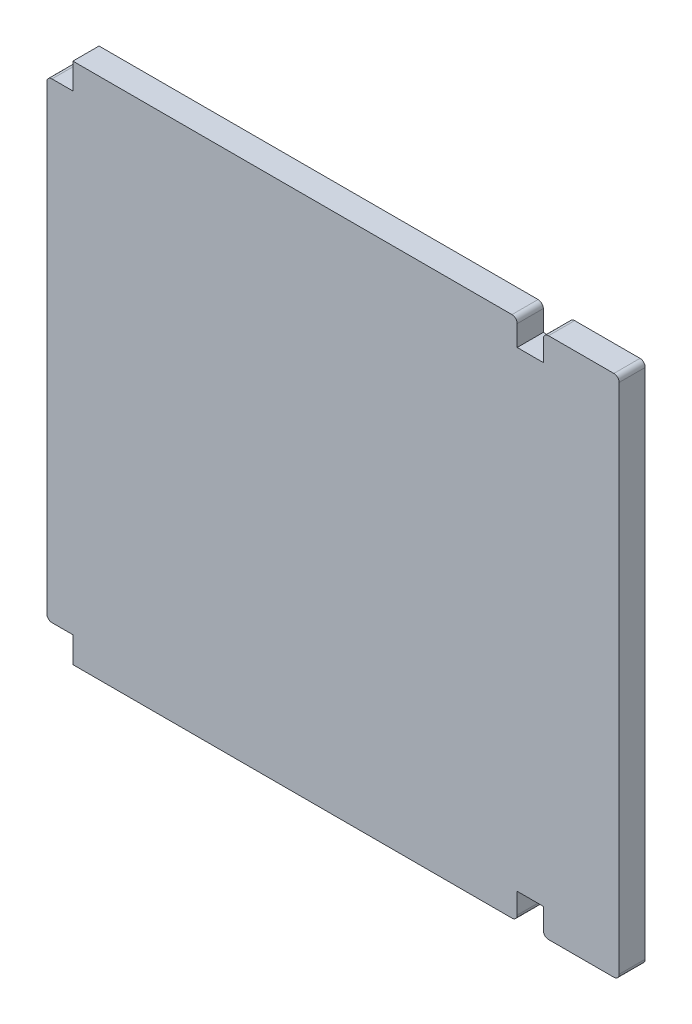
ISO-10303-21;
HEADER;
FILE_DESCRIPTION(('STEP AP214'),'2;1');
FILE_NAME('part.step','',(''),(''),'','','');
FILE_SCHEMA(('AUTOMOTIVE_DESIGN { 1 0 10303 214 1 1 1 1 }'));
ENDSEC;
DATA;
#1=APPLICATION_CONTEXT('core data for automotive mechanical design processes');
#2=APPLICATION_PROTOCOL_DEFINITION('international standard','automotive_design',2000,#1);
#3=PRODUCT_CONTEXT('',#1,'mechanical');
#4=PRODUCT('Part','Part','',(#3));
#5=PRODUCT_RELATED_PRODUCT_CATEGORY('part','',(#4));
#6=PRODUCT_DEFINITION_FORMATION('','',#4);
#7=PRODUCT_DEFINITION_CONTEXT('part definition',#1,'design');
#8=PRODUCT_DEFINITION('design','',#6,#7);
#9=PRODUCT_DEFINITION_SHAPE('','',#8);
#10=(LENGTH_UNIT() NAMED_UNIT(*) SI_UNIT(.MILLI.,.METRE.));
#11=(NAMED_UNIT(*) PLANE_ANGLE_UNIT() SI_UNIT($,.RADIAN.));
#12=(NAMED_UNIT(*) SI_UNIT($,.STERADIAN.) SOLID_ANGLE_UNIT());
#13=UNCERTAINTY_MEASURE_WITH_UNIT(LENGTH_MEASURE(1.E-05),#10,'distance_accuracy_value','');
#14=(GEOMETRIC_REPRESENTATION_CONTEXT(3) GLOBAL_UNCERTAINTY_ASSIGNED_CONTEXT((#13)) GLOBAL_UNIT_ASSIGNED_CONTEXT((#10,
#11,#12)) REPRESENTATION_CONTEXT('',''));
#15=CARTESIAN_POINT('',(0.,0.,0.));
#16=DIRECTION('',(0.,0.,1.));
#17=DIRECTION('',(1.,0.,0.));
#18=AXIS2_PLACEMENT_3D('',#15,#16,#17);
#19=CARTESIAN_POINT('',(0.,0.,5.));
#20=DIRECTION('',(1.,0.,0.));
#21=DIRECTION('',(0.,1.,0.));
#22=AXIS2_PLACEMENT_3D('',#19,#20,#21);
#23=PLANE('',#22);
#24=DIRECTION('',(0.,-1.,0.));
#25=VECTOR('',#24,1.);
#26=CARTESIAN_POINT('',(0.,0.,0.));
#27=LINE('',#26,#25);
#28=CARTESIAN_POINT('',(0.,4.95,0.));
#29=VERTEX_POINT('',#28);
#30=CARTESIAN_POINT('',(0.,0.,0.));
#31=VERTEX_POINT('',#30);
#32=EDGE_CURVE('E225',#29,#31,#27,.T.);
#33=ORIENTED_EDGE('',*,*,#32,.T.);
#34=DIRECTION('',(0.,0.,-1.));
#35=VECTOR('',#34,1.);
#36=CARTESIAN_POINT('',(0.,0.,5.));
#37=LINE('',#36,#35);
#38=CARTESIAN_POINT('',(0.,0.,5.));
#39=VERTEX_POINT('',#38);
#40=EDGE_CURVE('E207',#39,#31,#37,.T.);
#41=ORIENTED_EDGE('',*,*,#40,.F.);
#42=DIRECTION('',(0.,-1.,0.));
#43=VECTOR('',#42,1.);
#44=CARTESIAN_POINT('',(0.,0.,5.));
#45=LINE('',#44,#43);
#46=CARTESIAN_POINT('',(0.,4.95,5.));
#47=VERTEX_POINT('',#46);
#48=EDGE_CURVE('E213',#47,#39,#45,.T.);
#49=ORIENTED_EDGE('',*,*,#48,.F.);
#50=DIRECTION('',(0.,0.,-1.));
#51=VECTOR('',#50,1.);
#52=CARTESIAN_POINT('',(0.,4.95,5.));
#53=LINE('',#52,#51);
#54=EDGE_CURVE('E344',#47,#29,#53,.T.);
#55=ORIENTED_EDGE('',*,*,#54,.T.);
#56=EDGE_LOOP('',(#33,#41,#49,#55));
#57=FACE_BOUND('',#56,.T.);
#58=ADVANCED_FACE('F40',(#57),#23,.F.);
#59=CARTESIAN_POINT('',(0.,0.,5.));
#60=DIRECTION('',(0.,1.,0.));
#61=DIRECTION('',(0.,0.,1.));
#62=AXIS2_PLACEMENT_3D('',#59,#60,#61);
#63=PLANE('',#62);
#64=DIRECTION('',(1.,0.,0.));
#65=VECTOR('',#64,1.);
#66=CARTESIAN_POINT('',(0.,0.,0.));
#67=LINE('',#66,#65);
#68=CARTESIAN_POINT('',(84.,0.,0.));
#69=VERTEX_POINT('',#68);
#70=EDGE_CURVE('E370',#31,#69,#67,.T.);
#71=ORIENTED_EDGE('',*,*,#70,.T.);
#72=DIRECTION('',(0.,0.,-1.));
#73=VECTOR('',#72,1.);
#74=CARTESIAN_POINT('',(84.,0.,5.));
#75=LINE('',#74,#73);
#76=CARTESIAN_POINT('',(84.,0.,5.));
#77=VERTEX_POINT('',#76);
#78=EDGE_CURVE('E210',#69,#77,#75,.F.);
#79=ORIENTED_EDGE('',*,*,#78,.T.);
#80=DIRECTION('',(1.,0.,0.));
#81=VECTOR('',#80,1.);
#82=CARTESIAN_POINT('',(0.,0.,5.));
#83=LINE('',#82,#81);
#84=EDGE_CURVE('E202',#39,#77,#83,.T.);
#85=ORIENTED_EDGE('',*,*,#84,.F.);
#86=ORIENTED_EDGE('',*,*,#40,.T.);
#87=EDGE_LOOP('',(#71,#79,#85,#86));
#88=FACE_BOUND('',#87,.T.);
#89=ADVANCED_FACE('F205',(#88),#63,.F.);
#90=CARTESIAN_POINT('',(85.,0.,5.));
#91=DIRECTION('',(-1.,0.,0.));
#92=DIRECTION('',(0.,0.,1.));
#93=AXIS2_PLACEMENT_3D('',#90,#91,#92);
#94=PLANE('',#93);
#95=DIRECTION('',(0.,1.,0.));
#96=VECTOR('',#95,1.);
#97=CARTESIAN_POINT('',(85.,0.,5.));
#98=LINE('',#97,#96);
#99=CARTESIAN_POINT('',(85.,1.,5.));
#100=VERTEX_POINT('',#99);
#101=CARTESIAN_POINT('',(85.,4.95,5.));
#102=VERTEX_POINT('',#101);
#103=EDGE_CURVE('E212',#100,#102,#98,.T.);
#104=ORIENTED_EDGE('',*,*,#103,.F.);
#105=DIRECTION('',(0.,0.,-1.));
#106=VECTOR('',#105,1.);
#107=CARTESIAN_POINT('',(85.,1.,5.));
#108=LINE('',#107,#106);
#109=CARTESIAN_POINT('',(85.,1.,0.));
#110=VERTEX_POINT('',#109);
#111=EDGE_CURVE('E291',#100,#110,#108,.T.);
#112=ORIENTED_EDGE('',*,*,#111,.T.);
#113=DIRECTION('',(0.,1.,0.));
#114=VECTOR('',#113,1.);
#115=CARTESIAN_POINT('',(85.,0.,0.));
#116=LINE('',#115,#114);
#117=CARTESIAN_POINT('',(85.,4.95,0.));
#118=VERTEX_POINT('',#117);
#119=EDGE_CURVE('E369',#110,#118,#116,.T.);
#120=ORIENTED_EDGE('',*,*,#119,.T.);
#121=DIRECTION('',(0.,0.,-1.));
#122=VECTOR('',#121,1.);
#123=CARTESIAN_POINT('',(85.,4.95,5.));
#124=LINE('',#123,#122);
#125=EDGE_CURVE('E227',#102,#118,#124,.T.);
#126=ORIENTED_EDGE('',*,*,#125,.F.);
#127=EDGE_LOOP('',(#104,#112,#120,#126));
#128=FACE_BOUND('',#127,.T.);
#129=ADVANCED_FACE('F405',(#128),#94,.F.);
#130=CARTESIAN_POINT('',(85.,4.95,5.));
#131=DIRECTION('',(0.,1.,0.));
#132=DIRECTION('',(0.,0.,1.));
#133=AXIS2_PLACEMENT_3D('',#130,#131,#132);
#134=PLANE('',#133);
#135=DIRECTION('',(1.,0.,0.));
#136=VECTOR('',#135,1.);
#137=CARTESIAN_POINT('',(85.,4.95,0.));
#138=LINE('',#137,#136);
#139=CARTESIAN_POINT('',(90.,4.95,0.));
#140=VERTEX_POINT('',#139);
#141=EDGE_CURVE('E321',#118,#140,#138,.T.);
#142=ORIENTED_EDGE('',*,*,#141,.T.);
#143=DIRECTION('',(0.,0.,-1.));
#144=VECTOR('',#143,1.);
#145=CARTESIAN_POINT('',(90.,4.95,5.));
#146=LINE('',#145,#144);
#147=CARTESIAN_POINT('',(90.,4.95,5.));
#148=VERTEX_POINT('',#147);
#149=EDGE_CURVE('E232',#148,#140,#146,.T.);
#150=ORIENTED_EDGE('',*,*,#149,.F.);
#151=DIRECTION('',(1.,0.,0.));
#152=VECTOR('',#151,1.);
#153=CARTESIAN_POINT('',(85.,4.95,5.));
#154=LINE('',#153,#152);
#155=EDGE_CURVE('E399',#102,#148,#154,.T.);
#156=ORIENTED_EDGE('',*,*,#155,.F.);
#157=ORIENTED_EDGE('',*,*,#125,.T.);
#158=EDGE_LOOP('',(#142,#150,#156,#157));
#159=FACE_BOUND('',#158,.T.);
#160=ADVANCED_FACE('F406',(#159),#134,.F.);
#161=CARTESIAN_POINT('',(90.,4.95,5.));
#162=DIRECTION('',(1.,0.,0.));
#163=DIRECTION('',(0.,0.,-1.));
#164=AXIS2_PLACEMENT_3D('',#161,#162,#163);
#165=PLANE('',#164);
#166=DIRECTION('',(0.,-1.,0.));
#167=VECTOR('',#166,1.);
#168=CARTESIAN_POINT('',(90.,4.95,0.));
#169=LINE('',#168,#167);
#170=CARTESIAN_POINT('',(90.,0.949999999999995,0.));
#171=VERTEX_POINT('',#170);
#172=EDGE_CURVE('E316',#140,#171,#169,.T.);
#173=ORIENTED_EDGE('',*,*,#172,.T.);
#174=DIRECTION('',(0.,0.,-1.));
#175=VECTOR('',#174,1.);
#176=CARTESIAN_POINT('',(90.,0.949999999999995,5.));
#177=LINE('',#176,#175);
#178=CARTESIAN_POINT('',(90.,0.949999999999995,5.));
#179=VERTEX_POINT('',#178);
#180=EDGE_CURVE('E11',#171,#179,#177,.F.);
#181=ORIENTED_EDGE('',*,*,#180,.T.);
#182=DIRECTION('',(0.,-1.,0.));
#183=VECTOR('',#182,1.);
#184=CARTESIAN_POINT('',(90.,4.95,5.));
#185=LINE('',#184,#183);
#186=EDGE_CURVE('E364',#148,#179,#185,.T.);
#187=ORIENTED_EDGE('',*,*,#186,.F.);
#188=ORIENTED_EDGE('',*,*,#149,.T.);
#189=EDGE_LOOP('',(#173,#181,#187,#188));
#190=FACE_BOUND('',#189,.T.);
#191=ADVANCED_FACE('F361',(#190),#165,.F.);
#192=CARTESIAN_POINT('',(90.,-0.0500000000000049,5.));
#193=DIRECTION('',(0.,1.,0.));
#194=DIRECTION('',(-1.,0.,0.));
#195=AXIS2_PLACEMENT_3D('',#192,#193,#194);
#196=PLANE('',#195);
#197=DIRECTION('',(1.,0.,0.));
#198=VECTOR('',#197,1.);
#199=CARTESIAN_POINT('',(90.,-0.0500000000000049,5.));
#200=LINE('',#199,#198);
#201=CARTESIAN_POINT('',(91.,-0.0500000000000046,5.));
#202=VERTEX_POINT('',#201);
#203=CARTESIAN_POINT('',(103.5,-0.0500000000000008,5.));
#204=VERTEX_POINT('',#203);
#205=EDGE_CURVE('E306',#202,#204,#200,.T.);
#206=ORIENTED_EDGE('',*,*,#205,.F.);
#207=DIRECTION('',(0.,0.,-1.));
#208=VECTOR('',#207,1.);
#209=CARTESIAN_POINT('',(91.,-0.0500000000000046,5.));
#210=LINE('',#209,#208);
#211=CARTESIAN_POINT('',(91.,-0.0500000000000046,0.));
#212=VERTEX_POINT('',#211);
#213=EDGE_CURVE('E48',#202,#212,#210,.T.);
#214=ORIENTED_EDGE('',*,*,#213,.T.);
#215=DIRECTION('',(1.,0.,0.));
#216=VECTOR('',#215,1.);
#217=CARTESIAN_POINT('',(90.,-0.0500000000000049,0.));
#218=LINE('',#217,#216);
#219=CARTESIAN_POINT('',(103.5,-0.0500000000000008,0.));
#220=VERTEX_POINT('',#219);
#221=EDGE_CURVE('E303',#212,#220,#218,.T.);
#222=ORIENTED_EDGE('',*,*,#221,.T.);
#223=DIRECTION('',(0.,0.,-1.));
#224=VECTOR('',#223,1.);
#225=CARTESIAN_POINT('',(103.5,-0.0500000000000008,5.));
#226=LINE('',#225,#224);
#227=EDGE_CURVE('E295',#220,#204,#226,.F.);
#228=ORIENTED_EDGE('',*,*,#227,.T.);
#229=EDGE_LOOP('',(#206,#214,#222,#228));
#230=FACE_BOUND('',#229,.T.);
#231=ADVANCED_FACE('F302',(#230),#196,.F.);
#232=CARTESIAN_POINT('',(104.5,100.,5.));
#233=DIRECTION('',(-1.,0.,0.));
#234=DIRECTION('',(0.,-1.,0.));
#235=AXIS2_PLACEMENT_3D('',#232,#233,#234);
#236=PLANE('',#235);
#237=DIRECTION('',(0.,1.,0.));
#238=VECTOR('',#237,1.);
#239=CARTESIAN_POINT('',(104.5,100.,0.));
#240=LINE('',#239,#238);
#241=CARTESIAN_POINT('',(104.5,0.949999999999993,0.));
#242=VERTEX_POINT('',#241);
#243=CARTESIAN_POINT('',(104.5,99.,0.));
#244=VERTEX_POINT('',#243);
#245=EDGE_CURVE('E315',#242,#244,#240,.T.);
#246=ORIENTED_EDGE('',*,*,#245,.T.);
#247=DIRECTION('',(0.,0.,-1.));
#248=VECTOR('',#247,1.);
#249=CARTESIAN_POINT('',(104.5,99.,5.));
#250=LINE('',#249,#248);
#251=CARTESIAN_POINT('',(104.5,99.,5.));
#252=VERTEX_POINT('',#251);
#253=EDGE_CURVE('E257',#244,#252,#250,.F.);
#254=ORIENTED_EDGE('',*,*,#253,.T.);
#255=DIRECTION('',(0.,1.,0.));
#256=VECTOR('',#255,1.);
#257=CARTESIAN_POINT('',(104.5,100.,5.));
#258=LINE('',#257,#256);
#259=CARTESIAN_POINT('',(104.5,0.949999999999993,5.));
#260=VERTEX_POINT('',#259);
#261=EDGE_CURVE('E395',#260,#252,#258,.T.);
#262=ORIENTED_EDGE('',*,*,#261,.F.);
#263=DIRECTION('',(0.,0.,-1.));
#264=VECTOR('',#263,1.);
#265=CARTESIAN_POINT('',(104.5,0.949999999999993,5.));
#266=LINE('',#265,#264);
#267=EDGE_CURVE('E254',#260,#242,#266,.T.);
#268=ORIENTED_EDGE('',*,*,#267,.T.);
#269=EDGE_LOOP('',(#246,#254,#262,#268));
#270=FACE_BOUND('',#269,.T.);
#271=ADVANCED_FACE('F455',(#270),#236,.F.);
#272=CARTESIAN_POINT('',(90.,100.,5.));
#273=DIRECTION('',(0.,-1.,0.));
#274=DIRECTION('',(1.,0.,0.));
#275=AXIS2_PLACEMENT_3D('',#272,#273,#274);
#276=PLANE('',#275);
#277=DIRECTION('',(-1.,0.,0.));
#278=VECTOR('',#277,1.);
#279=CARTESIAN_POINT('',(90.,100.,5.));
#280=LINE('',#279,#278);
#281=CARTESIAN_POINT('',(103.5,100.,5.));
#282=VERTEX_POINT('',#281);
#283=CARTESIAN_POINT('',(91.,100.,5.));
#284=VERTEX_POINT('',#283);
#285=EDGE_CURVE('E392',#282,#284,#280,.T.);
#286=ORIENTED_EDGE('',*,*,#285,.F.);
#287=DIRECTION('',(0.,0.,-1.));
#288=VECTOR('',#287,1.);
#289=CARTESIAN_POINT('',(103.5,100.,5.));
#290=LINE('',#289,#288);
#291=CARTESIAN_POINT('',(103.5,100.,0.));
#292=VERTEX_POINT('',#291);
#293=EDGE_CURVE('E229',#282,#292,#290,.T.);
#294=ORIENTED_EDGE('',*,*,#293,.T.);
#295=DIRECTION('',(-1.,0.,0.));
#296=VECTOR('',#295,1.);
#297=CARTESIAN_POINT('',(90.,100.,0.));
#298=LINE('',#297,#296);
#299=CARTESIAN_POINT('',(91.,100.,0.));
#300=VERTEX_POINT('',#299);
#301=EDGE_CURVE('E319',#292,#300,#298,.T.);
#302=ORIENTED_EDGE('',*,*,#301,.T.);
#303=DIRECTION('',(0.,0.,-1.));
#304=VECTOR('',#303,1.);
#305=CARTESIAN_POINT('',(91.,100.,5.));
#306=LINE('',#305,#304);
#307=EDGE_CURVE('E226',#300,#284,#306,.F.);
#308=ORIENTED_EDGE('',*,*,#307,.T.);
#309=EDGE_LOOP('',(#286,#294,#302,#308));
#310=FACE_BOUND('',#309,.T.);
#311=ADVANCED_FACE('F461',(#310),#276,.F.);
#312=CARTESIAN_POINT('',(90.,100.,5.));
#313=DIRECTION('',(1.,0.,0.));
#314=DIRECTION('',(0.,0.,-1.));
#315=AXIS2_PLACEMENT_3D('',#312,#313,#314);
#316=PLANE('',#315);
#317=DIRECTION('',(0.,-1.,0.));
#318=VECTOR('',#317,1.);
#319=CARTESIAN_POINT('',(90.,100.,5.));
#320=LINE('',#319,#318);
#321=CARTESIAN_POINT('',(90.,99.,5.));
#322=VERTEX_POINT('',#321);
#323=CARTESIAN_POINT('',(90.,95.05,5.));
#324=VERTEX_POINT('',#323);
#325=EDGE_CURVE('E390',#322,#324,#320,.T.);
#326=ORIENTED_EDGE('',*,*,#325,.F.);
#327=DIRECTION('',(0.,0.,-1.));
#328=VECTOR('',#327,1.);
#329=CARTESIAN_POINT('',(90.,99.,5.));
#330=LINE('',#329,#328);
#331=CARTESIAN_POINT('',(90.,99.,0.));
#332=VERTEX_POINT('',#331);
#333=EDGE_CURVE('E279',#322,#332,#330,.T.);
#334=ORIENTED_EDGE('',*,*,#333,.T.);
#335=DIRECTION('',(0.,-1.,0.));
#336=VECTOR('',#335,1.);
#337=CARTESIAN_POINT('',(90.,100.,0.));
#338=LINE('',#337,#336);
#339=CARTESIAN_POINT('',(90.,95.05,0.));
#340=VERTEX_POINT('',#339);
#341=EDGE_CURVE('E327',#332,#340,#338,.T.);
#342=ORIENTED_EDGE('',*,*,#341,.T.);
#343=DIRECTION('',(0.,0.,-1.));
#344=VECTOR('',#343,1.);
#345=CARTESIAN_POINT('',(90.,95.05,5.));
#346=LINE('',#345,#344);
#347=EDGE_CURVE('E355',#324,#340,#346,.T.);
#348=ORIENTED_EDGE('',*,*,#347,.F.);
#349=EDGE_LOOP('',(#326,#334,#342,#348));
#350=FACE_BOUND('',#349,.T.);
#351=ADVANCED_FACE('F468',(#350),#316,.F.);
#352=CARTESIAN_POINT('',(85.,95.05,5.));
#353=DIRECTION('',(0.,-1.,0.));
#354=DIRECTION('',(0.,0.,-1.));
#355=AXIS2_PLACEMENT_3D('',#352,#353,#354);
#356=PLANE('',#355);
#357=DIRECTION('',(-1.,0.,0.));
#358=VECTOR('',#357,1.);
#359=CARTESIAN_POINT('',(85.,95.05,0.));
#360=LINE('',#359,#358);
#361=CARTESIAN_POINT('',(85.,95.05,0.));
#362=VERTEX_POINT('',#361);
#363=EDGE_CURVE('E329',#340,#362,#360,.T.);
#364=ORIENTED_EDGE('',*,*,#363,.T.);
#365=DIRECTION('',(0.,0.,-1.));
#366=VECTOR('',#365,1.);
#367=CARTESIAN_POINT('',(85.,95.05,5.));
#368=LINE('',#367,#366);
#369=CARTESIAN_POINT('',(85.,95.05,5.));
#370=VERTEX_POINT('',#369);
#371=EDGE_CURVE('E352',#370,#362,#368,.T.);
#372=ORIENTED_EDGE('',*,*,#371,.F.);
#373=DIRECTION('',(-1.,0.,0.));
#374=VECTOR('',#373,1.);
#375=CARTESIAN_POINT('',(85.,95.05,5.));
#376=LINE('',#375,#374);
#377=EDGE_CURVE('E388',#324,#370,#376,.T.);
#378=ORIENTED_EDGE('',*,*,#377,.F.);
#379=ORIENTED_EDGE('',*,*,#347,.T.);
#380=EDGE_LOOP('',(#364,#372,#378,#379));
#381=FACE_BOUND('',#380,.T.);
#382=ADVANCED_FACE('F474',(#381),#356,.F.);
#383=CARTESIAN_POINT('',(85.,95.05,5.));
#384=DIRECTION('',(-1.,0.,0.));
#385=DIRECTION('',(0.,0.,1.));
#386=AXIS2_PLACEMENT_3D('',#383,#384,#385);
#387=PLANE('',#386);
#388=DIRECTION('',(0.,1.,0.));
#389=VECTOR('',#388,1.);
#390=CARTESIAN_POINT('',(85.,95.05,0.));
#391=LINE('',#390,#389);
#392=CARTESIAN_POINT('',(85.,99.,0.));
#393=VERTEX_POINT('',#392);
#394=EDGE_CURVE('E331',#362,#393,#391,.T.);
#395=ORIENTED_EDGE('',*,*,#394,.T.);
#396=DIRECTION('',(0.,0.,-1.));
#397=VECTOR('',#396,1.);
#398=CARTESIAN_POINT('',(85.,99.,5.));
#399=LINE('',#398,#397);
#400=CARTESIAN_POINT('',(85.,99.,5.));
#401=VERTEX_POINT('',#400);
#402=EDGE_CURVE('E277',#393,#401,#399,.F.);
#403=ORIENTED_EDGE('',*,*,#402,.T.);
#404=DIRECTION('',(0.,1.,0.));
#405=VECTOR('',#404,1.);
#406=CARTESIAN_POINT('',(85.,95.05,5.));
#407=LINE('',#406,#405);
#408=EDGE_CURVE('E385',#370,#401,#407,.T.);
#409=ORIENTED_EDGE('',*,*,#408,.F.);
#410=ORIENTED_EDGE('',*,*,#371,.T.);
#411=EDGE_LOOP('',(#395,#403,#409,#410));
#412=FACE_BOUND('',#411,.T.);
#413=ADVANCED_FACE('F478',(#412),#387,.F.);
#414=CARTESIAN_POINT('',(0.,100.,5.));
#415=DIRECTION('',(0.,-1.,0.));
#416=DIRECTION('',(0.,0.,-1.));
#417=AXIS2_PLACEMENT_3D('',#414,#415,#416);
#418=PLANE('',#417);
#419=DIRECTION('',(-1.,0.,0.));
#420=VECTOR('',#419,1.);
#421=CARTESIAN_POINT('',(0.,100.,5.));
#422=LINE('',#421,#420);
#423=CARTESIAN_POINT('',(84.,100.,5.));
#424=VERTEX_POINT('',#423);
#425=CARTESIAN_POINT('',(0.,100.,5.));
#426=VERTEX_POINT('',#425);
#427=EDGE_CURVE('E383',#424,#426,#422,.T.);
#428=ORIENTED_EDGE('',*,*,#427,.F.);
#429=DIRECTION('',(0.,0.,-1.));
#430=VECTOR('',#429,1.);
#431=CARTESIAN_POINT('',(84.,100.,5.));
#432=LINE('',#431,#430);
#433=CARTESIAN_POINT('',(84.,100.,0.));
#434=VERTEX_POINT('',#433);
#435=EDGE_CURVE('E274',#424,#434,#432,.T.);
#436=ORIENTED_EDGE('',*,*,#435,.T.);
#437=DIRECTION('',(-1.,0.,0.));
#438=VECTOR('',#437,1.);
#439=CARTESIAN_POINT('',(0.,100.,0.));
#440=LINE('',#439,#438);
#441=CARTESIAN_POINT('',(0.,100.,0.));
#442=VERTEX_POINT('',#441);
#443=EDGE_CURVE('E334',#434,#442,#440,.T.);
#444=ORIENTED_EDGE('',*,*,#443,.T.);
#445=DIRECTION('',(0.,0.,-1.));
#446=VECTOR('',#445,1.);
#447=CARTESIAN_POINT('',(0.,100.,5.));
#448=LINE('',#447,#446);
#449=EDGE_CURVE('E349',#426,#442,#448,.T.);
#450=ORIENTED_EDGE('',*,*,#449,.F.);
#451=EDGE_LOOP('',(#428,#436,#444,#450));
#452=FACE_BOUND('',#451,.T.);
#453=ADVANCED_FACE('F485',(#452),#418,.F.);
#454=CARTESIAN_POINT('',(0.,95.05,5.));
#455=DIRECTION('',(1.,0.,0.));
#456=DIRECTION('',(0.,0.,-1.));
#457=AXIS2_PLACEMENT_3D('',#454,#455,#456);
#458=PLANE('',#457);
#459=DIRECTION('',(0.,-1.,0.));
#460=VECTOR('',#459,1.);
#461=CARTESIAN_POINT('',(0.,95.05,0.));
#462=LINE('',#461,#460);
#463=CARTESIAN_POINT('',(0.,95.05,0.));
#464=VERTEX_POINT('',#463);
#465=EDGE_CURVE('E336',#442,#464,#462,.T.);
#466=ORIENTED_EDGE('',*,*,#465,.T.);
#467=DIRECTION('',(0.,0.,-1.));
#468=VECTOR('',#467,1.);
#469=CARTESIAN_POINT('',(0.,95.05,5.));
#470=LINE('',#469,#468);
#471=CARTESIAN_POINT('',(0.,95.05,5.));
#472=VERTEX_POINT('',#471);
#473=EDGE_CURVE('E346',#472,#464,#470,.T.);
#474=ORIENTED_EDGE('',*,*,#473,.F.);
#475=DIRECTION('',(0.,-1.,0.));
#476=VECTOR('',#475,1.);
#477=CARTESIAN_POINT('',(0.,95.05,5.));
#478=LINE('',#477,#476);
#479=EDGE_CURVE('E381',#426,#472,#478,.T.);
#480=ORIENTED_EDGE('',*,*,#479,.F.);
#481=ORIENTED_EDGE('',*,*,#449,.T.);
#482=EDGE_LOOP('',(#466,#474,#480,#481));
#483=FACE_BOUND('',#482,.T.);
#484=ADVANCED_FACE('F491',(#483),#458,.F.);
#485=CARTESIAN_POINT('',(0.,95.05,5.));
#486=DIRECTION('',(0.,-1.,0.));
#487=DIRECTION('',(0.,0.,-1.));
#488=AXIS2_PLACEMENT_3D('',#485,#486,#487);
#489=PLANE('',#488);
#490=DIRECTION('',(-1.,0.,0.));
#491=VECTOR('',#490,1.);
#492=CARTESIAN_POINT('',(0.,95.05,0.));
#493=LINE('',#492,#491);
#494=CARTESIAN_POINT('',(-4.,95.05,0.));
#495=VERTEX_POINT('',#494);
#496=EDGE_CURVE('E338',#464,#495,#493,.T.);
#497=ORIENTED_EDGE('',*,*,#496,.T.);
#498=DIRECTION('',(0.,0.,-1.));
#499=VECTOR('',#498,1.);
#500=CARTESIAN_POINT('',(-4.,95.05,5.));
#501=LINE('',#500,#499);
#502=CARTESIAN_POINT('',(-4.,95.05,5.));
#503=VERTEX_POINT('',#502);
#504=EDGE_CURVE('E286',#495,#503,#501,.F.);
#505=ORIENTED_EDGE('',*,*,#504,.T.);
#506=DIRECTION('',(-1.,0.,0.));
#507=VECTOR('',#506,1.);
#508=CARTESIAN_POINT('',(0.,95.05,5.));
#509=LINE('',#508,#507);
#510=EDGE_CURVE('E378',#472,#503,#509,.T.);
#511=ORIENTED_EDGE('',*,*,#510,.F.);
#512=ORIENTED_EDGE('',*,*,#473,.T.);
#513=EDGE_LOOP('',(#497,#505,#511,#512));
#514=FACE_BOUND('',#513,.T.);
#515=ADVANCED_FACE('F495',(#514),#489,.F.);
#516=CARTESIAN_POINT('',(-5.,95.05,5.));
#517=DIRECTION('',(1.,0.,0.));
#518=DIRECTION('',(0.,1.,0.));
#519=AXIS2_PLACEMENT_3D('',#516,#517,#518);
#520=PLANE('',#519);
#521=DIRECTION('',(0.,-1.,0.));
#522=VECTOR('',#521,1.);
#523=CARTESIAN_POINT('',(-5.,95.05,5.));
#524=LINE('',#523,#522);
#525=CARTESIAN_POINT('',(-5.,94.05,5.));
#526=VERTEX_POINT('',#525);
#527=CARTESIAN_POINT('',(-4.99999999999999,5.95,5.));
#528=VERTEX_POINT('',#527);
#529=EDGE_CURVE('E376',#526,#528,#524,.T.);
#530=ORIENTED_EDGE('',*,*,#529,.F.);
#531=DIRECTION('',(0.,0.,-1.));
#532=VECTOR('',#531,1.);
#533=CARTESIAN_POINT('',(-5.,94.05,5.));
#534=LINE('',#533,#532);
#535=CARTESIAN_POINT('',(-5.,94.05,0.));
#536=VERTEX_POINT('',#535);
#537=EDGE_CURVE('E283',#526,#536,#534,.T.);
#538=ORIENTED_EDGE('',*,*,#537,.T.);
#539=DIRECTION('',(0.,-1.,0.));
#540=VECTOR('',#539,1.);
#541=CARTESIAN_POINT('',(-5.,95.05,0.));
#542=LINE('',#541,#540);
#543=CARTESIAN_POINT('',(-4.99999999999999,5.95,0.));
#544=VERTEX_POINT('',#543);
#545=EDGE_CURVE('E341',#536,#544,#542,.T.);
#546=ORIENTED_EDGE('',*,*,#545,.T.);
#547=DIRECTION('',(0.,0.,-1.));
#548=VECTOR('',#547,1.);
#549=CARTESIAN_POINT('',(-4.99999999999999,5.95,5.));
#550=LINE('',#549,#548);
#551=EDGE_CURVE('E63',#544,#528,#550,.F.);
#552=ORIENTED_EDGE('',*,*,#551,.T.);
#553=EDGE_LOOP('',(#530,#538,#546,#552));
#554=FACE_BOUND('',#553,.T.);
#555=ADVANCED_FACE('F500',(#554),#520,.F.);
#556=CARTESIAN_POINT('',(0.,4.95,5.));
#557=DIRECTION('',(0.,1.,0.));
#558=DIRECTION('',(-1.,0.,0.));
#559=AXIS2_PLACEMENT_3D('',#556,#557,#558);
#560=PLANE('',#559);
#561=DIRECTION('',(1.,0.,0.));
#562=VECTOR('',#561,1.);
#563=CARTESIAN_POINT('',(0.,4.95,5.));
#564=LINE('',#563,#562);
#565=CARTESIAN_POINT('',(-3.99999999999999,4.95,5.));
#566=VERTEX_POINT('',#565);
#567=EDGE_CURVE('E218',#566,#47,#564,.T.);
#568=ORIENTED_EDGE('',*,*,#567,.F.);
#569=DIRECTION('',(0.,0.,-1.));
#570=VECTOR('',#569,1.);
#571=CARTESIAN_POINT('',(-3.99999999999999,4.95,5.));
#572=LINE('',#571,#570);
#573=CARTESIAN_POINT('',(-3.99999999999999,4.95,0.));
#574=VERTEX_POINT('',#573);
#575=EDGE_CURVE('E288',#566,#574,#572,.T.);
#576=ORIENTED_EDGE('',*,*,#575,.T.);
#577=DIRECTION('',(1.,0.,0.));
#578=VECTOR('',#577,1.);
#579=CARTESIAN_POINT('',(0.,4.95,0.));
#580=LINE('',#579,#578);
#581=EDGE_CURVE('E222',#574,#29,#580,.T.);
#582=ORIENTED_EDGE('',*,*,#581,.T.);
#583=ORIENTED_EDGE('',*,*,#54,.F.);
#584=EDGE_LOOP('',(#568,#576,#582,#583));
#585=FACE_BOUND('',#584,.T.);
#586=ADVANCED_FACE('F504',(#585),#560,.F.);
#587=CARTESIAN_POINT('',(0.,0.,5.));
#588=DIRECTION('',(0.,0.,1.));
#589=DIRECTION('',(1.,0.,0.));
#590=AXIS2_PLACEMENT_3D('',#587,#588,#589);
#591=PLANE('',#590);
#592=ORIENTED_EDGE('',*,*,#261,.T.);
#593=CARTESIAN_POINT('',(103.5,99.,5.));
#594=DIRECTION('',(0.,0.,1.));
#595=DIRECTION('',(1.,0.,0.));
#596=AXIS2_PLACEMENT_3D('',#593,#594,#595);
#597=CIRCLE('',#596,1.);
#598=EDGE_CURVE('E272',#252,#282,#597,.T.);
#599=ORIENTED_EDGE('',*,*,#598,.T.);
#600=ORIENTED_EDGE('',*,*,#285,.T.);
#601=CARTESIAN_POINT('',(91.,99.,5.));
#602=DIRECTION('',(0.,0.,1.));
#603=DIRECTION('',(1.,0.,0.));
#604=AXIS2_PLACEMENT_3D('',#601,#602,#603);
#605=CIRCLE('',#604,1.);
#606=EDGE_CURVE('E268',#284,#322,#605,.T.);
#607=ORIENTED_EDGE('',*,*,#606,.T.);
#608=ORIENTED_EDGE('',*,*,#325,.T.);
#609=ORIENTED_EDGE('',*,*,#377,.T.);
#610=ORIENTED_EDGE('',*,*,#408,.T.);
#611=CARTESIAN_POINT('',(84.,99.,5.));
#612=DIRECTION('',(0.,0.,1.));
#613=DIRECTION('',(1.,0.,0.));
#614=AXIS2_PLACEMENT_3D('',#611,#612,#613);
#615=CIRCLE('',#614,1.);
#616=EDGE_CURVE('E270',#401,#424,#615,.T.);
#617=ORIENTED_EDGE('',*,*,#616,.T.);
#618=ORIENTED_EDGE('',*,*,#427,.T.);
#619=ORIENTED_EDGE('',*,*,#479,.T.);
#620=ORIENTED_EDGE('',*,*,#510,.T.);
#621=CARTESIAN_POINT('',(-4.,94.05,5.));
#622=DIRECTION('',(0.,0.,1.));
#623=DIRECTION('',(1.,0.,0.));
#624=AXIS2_PLACEMENT_3D('',#621,#622,#623);
#625=CIRCLE('',#624,1.);
#626=EDGE_CURVE('E266',#503,#526,#625,.T.);
#627=ORIENTED_EDGE('',*,*,#626,.T.);
#628=ORIENTED_EDGE('',*,*,#529,.T.);
#629=CARTESIAN_POINT('',(-3.99999999999999,5.95,5.));
#630=DIRECTION('',(0.,0.,1.));
#631=DIRECTION('',(1.,0.,0.));
#632=AXIS2_PLACEMENT_3D('',#629,#630,#631);
#633=CIRCLE('',#632,1.);
#634=EDGE_CURVE('E55',#528,#566,#633,.T.);
#635=ORIENTED_EDGE('',*,*,#634,.T.);
#636=ORIENTED_EDGE('',*,*,#567,.T.);
#637=ORIENTED_EDGE('',*,*,#48,.T.);
#638=ORIENTED_EDGE('',*,*,#84,.T.);
#639=CARTESIAN_POINT('',(84.,1.,5.));
#640=DIRECTION('',(0.,0.,1.));
#641=DIRECTION('',(1.,0.,0.));
#642=AXIS2_PLACEMENT_3D('',#639,#640,#641);
#643=CIRCLE('',#642,1.);
#644=EDGE_CURVE('E263',#77,#100,#643,.T.);
#645=ORIENTED_EDGE('',*,*,#644,.T.);
#646=ORIENTED_EDGE('',*,*,#103,.T.);
#647=ORIENTED_EDGE('',*,*,#155,.T.);
#648=ORIENTED_EDGE('',*,*,#186,.T.);
#649=CARTESIAN_POINT('',(91.,0.949999999999995,5.));
#650=DIRECTION('',(0.,0.,1.));
#651=DIRECTION('',(1.,0.,0.));
#652=AXIS2_PLACEMENT_3D('',#649,#650,#651);
#653=CIRCLE('',#652,1.);
#654=EDGE_CURVE('E261',#179,#202,#653,.T.);
#655=ORIENTED_EDGE('',*,*,#654,.T.);
#656=ORIENTED_EDGE('',*,*,#205,.T.);
#657=CARTESIAN_POINT('',(103.5,0.949999999999993,5.));
#658=DIRECTION('',(0.,0.,1.));
#659=DIRECTION('',(1.,0.,0.));
#660=AXIS2_PLACEMENT_3D('',#657,#658,#659);
#661=CIRCLE('',#660,1.);
#662=EDGE_CURVE('E259',#204,#260,#661,.T.);
#663=ORIENTED_EDGE('',*,*,#662,.T.);
#664=EDGE_LOOP('',(#592,#599,#600,#607,#608,#609,#610,#617,#618,#619,#620,#627,#628,#635,#636,
#637,#638,#645,#646,#647,#648,#655,#656,#663));
#665=FACE_BOUND('',#664,.T.);
#666=ADVANCED_FACE('F217',(#665),#591,.T.);
#667=CARTESIAN_POINT('',(0.,0.,0.));
#668=DIRECTION('',(0.,0.,1.));
#669=DIRECTION('',(1.,0.,0.));
#670=AXIS2_PLACEMENT_3D('',#667,#668,#669);
#671=PLANE('',#670);
#672=ORIENTED_EDGE('',*,*,#301,.F.);
#673=CARTESIAN_POINT('',(103.5,99.,0.));
#674=DIRECTION('',(0.,0.,1.));
#675=DIRECTION('',(1.,0.,0.));
#676=AXIS2_PLACEMENT_3D('',#673,#674,#675);
#677=CIRCLE('',#676,1.);
#678=EDGE_CURVE('E252',#292,#244,#677,.F.);
#679=ORIENTED_EDGE('',*,*,#678,.T.);
#680=ORIENTED_EDGE('',*,*,#245,.F.);
#681=CARTESIAN_POINT('',(103.5,0.949999999999993,0.));
#682=DIRECTION('',(0.,0.,1.));
#683=DIRECTION('',(1.,0.,0.));
#684=AXIS2_PLACEMENT_3D('',#681,#682,#683);
#685=CIRCLE('',#684,1.);
#686=EDGE_CURVE('E238',#242,#220,#685,.F.);
#687=ORIENTED_EDGE('',*,*,#686,.T.);
#688=ORIENTED_EDGE('',*,*,#221,.F.);
#689=CARTESIAN_POINT('',(91.,0.949999999999995,0.));
#690=DIRECTION('',(0.,0.,1.));
#691=DIRECTION('',(1.,0.,0.));
#692=AXIS2_PLACEMENT_3D('',#689,#690,#691);
#693=CIRCLE('',#692,1.);
#694=EDGE_CURVE('E240',#212,#171,#693,.F.);
#695=ORIENTED_EDGE('',*,*,#694,.T.);
#696=ORIENTED_EDGE('',*,*,#172,.F.);
#697=ORIENTED_EDGE('',*,*,#141,.F.);
#698=ORIENTED_EDGE('',*,*,#119,.F.);
#699=CARTESIAN_POINT('',(84.,1.,0.));
#700=DIRECTION('',(0.,0.,1.));
#701=DIRECTION('',(1.,0.,0.));
#702=AXIS2_PLACEMENT_3D('',#699,#700,#701);
#703=CIRCLE('',#702,1.);
#704=EDGE_CURVE('E242',#110,#69,#703,.F.);
#705=ORIENTED_EDGE('',*,*,#704,.T.);
#706=ORIENTED_EDGE('',*,*,#70,.F.);
#707=ORIENTED_EDGE('',*,*,#32,.F.);
#708=ORIENTED_EDGE('',*,*,#581,.F.);
#709=CARTESIAN_POINT('',(-3.99999999999999,5.95,0.));
#710=DIRECTION('',(0.,0.,1.));
#711=DIRECTION('',(1.,0.,0.));
#712=AXIS2_PLACEMENT_3D('',#709,#710,#711);
#713=CIRCLE('',#712,1.);
#714=EDGE_CURVE('E244',#574,#544,#713,.F.);
#715=ORIENTED_EDGE('',*,*,#714,.T.);
#716=ORIENTED_EDGE('',*,*,#545,.F.);
#717=CARTESIAN_POINT('',(-4.,94.05,0.));
#718=DIRECTION('',(0.,0.,1.));
#719=DIRECTION('',(1.,0.,0.));
#720=AXIS2_PLACEMENT_3D('',#717,#718,#719);
#721=CIRCLE('',#720,1.);
#722=EDGE_CURVE('E246',#536,#495,#721,.F.);
#723=ORIENTED_EDGE('',*,*,#722,.T.);
#724=ORIENTED_EDGE('',*,*,#496,.F.);
#725=ORIENTED_EDGE('',*,*,#465,.F.);
#726=ORIENTED_EDGE('',*,*,#443,.F.);
#727=CARTESIAN_POINT('',(84.,99.,0.));
#728=DIRECTION('',(0.,0.,1.));
#729=DIRECTION('',(1.,0.,0.));
#730=AXIS2_PLACEMENT_3D('',#727,#728,#729);
#731=CIRCLE('',#730,1.);
#732=EDGE_CURVE('E250',#434,#393,#731,.F.);
#733=ORIENTED_EDGE('',*,*,#732,.T.);
#734=ORIENTED_EDGE('',*,*,#394,.F.);
#735=ORIENTED_EDGE('',*,*,#363,.F.);
#736=ORIENTED_EDGE('',*,*,#341,.F.);
#737=CARTESIAN_POINT('',(91.,99.,0.));
#738=DIRECTION('',(0.,0.,1.));
#739=DIRECTION('',(1.,0.,0.));
#740=AXIS2_PLACEMENT_3D('',#737,#738,#739);
#741=CIRCLE('',#740,1.);
#742=EDGE_CURVE('E248',#332,#300,#741,.F.);
#743=ORIENTED_EDGE('',*,*,#742,.T.);
#744=EDGE_LOOP('',(#672,#679,#680,#687,#688,#695,#696,#697,#698,#705,#706,#707,#708,#715,#716,
#723,#724,#725,#726,#733,#734,#735,#736,#743));
#745=FACE_BOUND('',#744,.T.);
#746=ADVANCED_FACE('F311',(#745),#671,.F.);
#747=CARTESIAN_POINT('',(103.5,99.,5.));
#748=DIRECTION('',(0.,0.,-1.));
#749=DIRECTION('',(-1.,0.,0.));
#750=AXIS2_PLACEMENT_3D('',#747,#748,#749);
#751=CYLINDRICAL_SURFACE('',#750,1.);
#752=ORIENTED_EDGE('',*,*,#598,.F.);
#753=ORIENTED_EDGE('',*,*,#253,.F.);
#754=ORIENTED_EDGE('',*,*,#678,.F.);
#755=ORIENTED_EDGE('',*,*,#293,.F.);
#756=EDGE_LOOP('',(#752,#753,#754,#755));
#757=FACE_BOUND('',#756,.T.);
#758=ADVANCED_FACE('F422',(#757),#751,.T.);
#759=CARTESIAN_POINT('',(84.,99.,5.));
#760=DIRECTION('',(0.,0.,-1.));
#761=DIRECTION('',(-1.,0.,0.));
#762=AXIS2_PLACEMENT_3D('',#759,#760,#761);
#763=CYLINDRICAL_SURFACE('',#762,1.);
#764=ORIENTED_EDGE('',*,*,#616,.F.);
#765=ORIENTED_EDGE('',*,*,#402,.F.);
#766=ORIENTED_EDGE('',*,*,#732,.F.);
#767=ORIENTED_EDGE('',*,*,#435,.F.);
#768=EDGE_LOOP('',(#764,#765,#766,#767));
#769=FACE_BOUND('',#768,.T.);
#770=ADVANCED_FACE('F425',(#769),#763,.T.);
#771=CARTESIAN_POINT('',(91.,99.,5.));
#772=DIRECTION('',(0.,0.,-1.));
#773=DIRECTION('',(-1.,0.,0.));
#774=AXIS2_PLACEMENT_3D('',#771,#772,#773);
#775=CYLINDRICAL_SURFACE('',#774,1.);
#776=ORIENTED_EDGE('',*,*,#606,.F.);
#777=ORIENTED_EDGE('',*,*,#307,.F.);
#778=ORIENTED_EDGE('',*,*,#742,.F.);
#779=ORIENTED_EDGE('',*,*,#333,.F.);
#780=EDGE_LOOP('',(#776,#777,#778,#779));
#781=FACE_BOUND('',#780,.T.);
#782=ADVANCED_FACE('F429',(#781),#775,.T.);
#783=CARTESIAN_POINT('',(-4.,94.05,5.));
#784=DIRECTION('',(0.,0.,-1.));
#785=DIRECTION('',(-1.,0.,0.));
#786=AXIS2_PLACEMENT_3D('',#783,#784,#785);
#787=CYLINDRICAL_SURFACE('',#786,1.);
#788=ORIENTED_EDGE('',*,*,#626,.F.);
#789=ORIENTED_EDGE('',*,*,#504,.F.);
#790=ORIENTED_EDGE('',*,*,#722,.F.);
#791=ORIENTED_EDGE('',*,*,#537,.F.);
#792=EDGE_LOOP('',(#788,#789,#790,#791));
#793=FACE_BOUND('',#792,.T.);
#794=ADVANCED_FACE('F433',(#793),#787,.T.);
#795=CARTESIAN_POINT('',(-3.99999999999999,5.95,5.));
#796=DIRECTION('',(0.,0.,-1.));
#797=DIRECTION('',(-1.,0.,0.));
#798=AXIS2_PLACEMENT_3D('',#795,#796,#797);
#799=CYLINDRICAL_SURFACE('',#798,1.);
#800=ORIENTED_EDGE('',*,*,#634,.F.);
#801=ORIENTED_EDGE('',*,*,#551,.F.);
#802=ORIENTED_EDGE('',*,*,#714,.F.);
#803=ORIENTED_EDGE('',*,*,#575,.F.);
#804=EDGE_LOOP('',(#800,#801,#802,#803));
#805=FACE_BOUND('',#804,.T.);
#806=ADVANCED_FACE('F437',(#805),#799,.T.);
#807=CARTESIAN_POINT('',(84.,1.,5.));
#808=DIRECTION('',(0.,0.,-1.));
#809=DIRECTION('',(-1.,0.,0.));
#810=AXIS2_PLACEMENT_3D('',#807,#808,#809);
#811=CYLINDRICAL_SURFACE('',#810,1.);
#812=ORIENTED_EDGE('',*,*,#644,.F.);
#813=ORIENTED_EDGE('',*,*,#78,.F.);
#814=ORIENTED_EDGE('',*,*,#704,.F.);
#815=ORIENTED_EDGE('',*,*,#111,.F.);
#816=EDGE_LOOP('',(#812,#813,#814,#815));
#817=FACE_BOUND('',#816,.T.);
#818=ADVANCED_FACE('F441',(#817),#811,.T.);
#819=CARTESIAN_POINT('',(91.,0.949999999999995,5.));
#820=DIRECTION('',(0.,0.,-1.));
#821=DIRECTION('',(-1.,0.,0.));
#822=AXIS2_PLACEMENT_3D('',#819,#820,#821);
#823=CYLINDRICAL_SURFACE('',#822,1.);
#824=ORIENTED_EDGE('',*,*,#654,.F.);
#825=ORIENTED_EDGE('',*,*,#180,.F.);
#826=ORIENTED_EDGE('',*,*,#694,.F.);
#827=ORIENTED_EDGE('',*,*,#213,.F.);
#828=EDGE_LOOP('',(#824,#825,#826,#827));
#829=FACE_BOUND('',#828,.T.);
#830=ADVANCED_FACE('F444',(#829),#823,.T.);
#831=CARTESIAN_POINT('',(103.5,0.949999999999993,5.));
#832=DIRECTION('',(0.,0.,-1.));
#833=DIRECTION('',(-1.,0.,0.));
#834=AXIS2_PLACEMENT_3D('',#831,#832,#833);
#835=CYLINDRICAL_SURFACE('',#834,1.);
#836=ORIENTED_EDGE('',*,*,#662,.F.);
#837=ORIENTED_EDGE('',*,*,#227,.F.);
#838=ORIENTED_EDGE('',*,*,#686,.F.);
#839=ORIENTED_EDGE('',*,*,#267,.F.);
#840=EDGE_LOOP('',(#836,#837,#838,#839));
#841=FACE_BOUND('',#840,.T.);
#842=ADVANCED_FACE('F42',(#841),#835,.T.);
#843=CLOSED_SHELL('',(#58,#89,#129,#160,#191,#231,#271,#311,#351,#382,#413,#453,#484,#515,#555,
#586,#666,#746,#758,#770,#782,#794,#806,#818,#830,#842));
#844=MANIFOLD_SOLID_BREP('B2',#843);
#845=ADVANCED_BREP_SHAPE_REPRESENTATION('',(#18,#844),#14);
#846=SHAPE_DEFINITION_REPRESENTATION(#9,#845);
ENDSEC;
END-ISO-10303-21;
